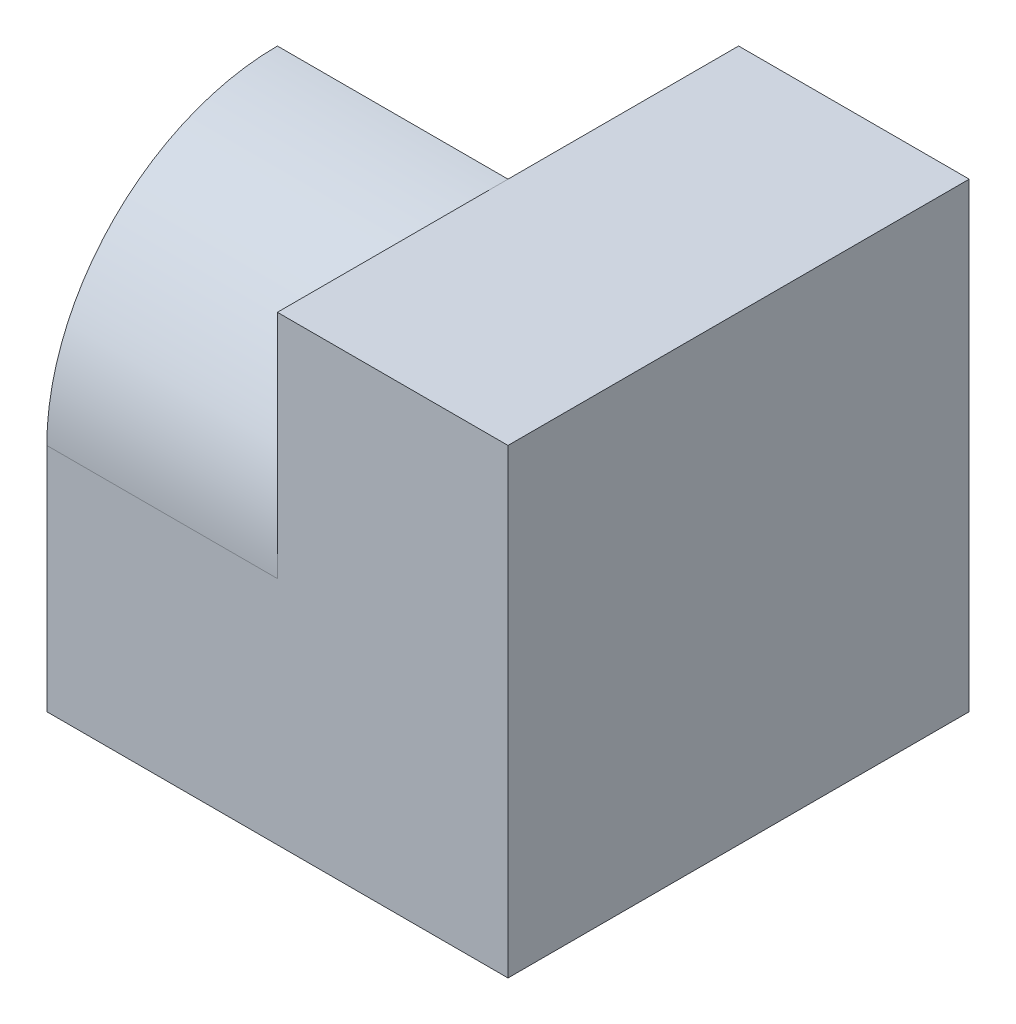
ISO-10303-21;
HEADER;
FILE_DESCRIPTION(('STEP AP214'),'2;1');
FILE_NAME('part.step','',(''),(''),'','','');
FILE_SCHEMA(('AUTOMOTIVE_DESIGN { 1 0 10303 214 1 1 1 1 }'));
ENDSEC;
DATA;
#1=APPLICATION_CONTEXT('core data for automotive mechanical design processes');
#2=APPLICATION_PROTOCOL_DEFINITION('international standard','automotive_design',2000,#1);
#3=PRODUCT_CONTEXT('',#1,'mechanical');
#4=PRODUCT('Part','Part','',(#3));
#5=PRODUCT_RELATED_PRODUCT_CATEGORY('part','',(#4));
#6=PRODUCT_DEFINITION_FORMATION('','',#4);
#7=PRODUCT_DEFINITION_CONTEXT('part definition',#1,'design');
#8=PRODUCT_DEFINITION('design','',#6,#7);
#9=PRODUCT_DEFINITION_SHAPE('','',#8);
#10=(LENGTH_UNIT() NAMED_UNIT(*) SI_UNIT(.MILLI.,.METRE.));
#11=(NAMED_UNIT(*) PLANE_ANGLE_UNIT() SI_UNIT($,.RADIAN.));
#12=(NAMED_UNIT(*) SI_UNIT($,.STERADIAN.) SOLID_ANGLE_UNIT());
#13=UNCERTAINTY_MEASURE_WITH_UNIT(LENGTH_MEASURE(1.E-05),#10,'distance_accuracy_value','');
#14=(GEOMETRIC_REPRESENTATION_CONTEXT(3) GLOBAL_UNCERTAINTY_ASSIGNED_CONTEXT((#13)) GLOBAL_UNIT_ASSIGNED_CONTEXT((#10,
#11,#12)) REPRESENTATION_CONTEXT('',''));
#15=CARTESIAN_POINT('',(0.,0.,0.));
#16=DIRECTION('',(0.,0.,1.));
#17=DIRECTION('',(1.,0.,0.));
#18=AXIS2_PLACEMENT_3D('',#15,#16,#17);
#19=CARTESIAN_POINT('',(-2.,4.,2.));
#20=DIRECTION('',(1.,0.,0.));
#21=DIRECTION('',(0.,0.,-1.));
#22=AXIS2_PLACEMENT_3D('',#19,#20,#21);
#23=PLANE('',#22);
#24=DIRECTION('',(0.,-1.,0.));
#25=VECTOR('',#24,1.);
#26=CARTESIAN_POINT('',(-2.,4.,2.));
#27=LINE('',#26,#25);
#28=CARTESIAN_POINT('',(-2.,1.99999999999999,2.));
#29=VERTEX_POINT('',#28);
#30=CARTESIAN_POINT('',(-2.,0.,2.));
#31=VERTEX_POINT('',#30);
#32=EDGE_CURVE('E81',#29,#31,#27,.T.);
#33=ORIENTED_EDGE('',*,*,#32,.F.);
#34=CARTESIAN_POINT('',(-2.,1.99999999999999,0.));
#35=DIRECTION('',(-1.,0.,0.));
#36=DIRECTION('',(0.,0.,1.));
#37=AXIS2_PLACEMENT_3D('',#34,#35,#36);
#38=CIRCLE('',#37,2.00000000000001);
#39=CARTESIAN_POINT('',(-2.,4.,0.));
#40=VERTEX_POINT('',#39);
#41=EDGE_CURVE('E140',#40,#29,#38,.F.);
#42=ORIENTED_EDGE('',*,*,#41,.F.);
#43=DIRECTION('',(0.,-0.707106781186548,-0.707106781186548));
#44=VECTOR('',#43,1.);
#45=CARTESIAN_POINT('',(-2.,2.,-2.));
#46=LINE('',#45,#44);
#47=CARTESIAN_POINT('',(-2.,2.,-2.));
#48=VERTEX_POINT('',#47);
#49=EDGE_CURVE('E113',#40,#48,#46,.T.);
#50=ORIENTED_EDGE('',*,*,#49,.T.);
#51=DIRECTION('',(0.,-1.,0.));
#52=VECTOR('',#51,1.);
#53=CARTESIAN_POINT('',(-2.,4.,-2.));
#54=LINE('',#53,#52);
#55=CARTESIAN_POINT('',(-2.,0.,-2.));
#56=VERTEX_POINT('',#55);
#57=EDGE_CURVE('E40',#48,#56,#54,.T.);
#58=ORIENTED_EDGE('',*,*,#57,.T.);
#59=DIRECTION('',(0.,0.,1.));
#60=VECTOR('',#59,1.);
#61=CARTESIAN_POINT('',(-2.,0.,2.));
#62=LINE('',#61,#60);
#63=EDGE_CURVE('E87',#56,#31,#62,.T.);
#64=ORIENTED_EDGE('',*,*,#63,.T.);
#65=EDGE_LOOP('',(#33,#42,#50,#58,#64));
#66=FACE_BOUND('',#65,.T.);
#67=ADVANCED_FACE('F32',(#66),#23,.F.);
#68=CARTESIAN_POINT('',(0.,4.,0.));
#69=DIRECTION('',(0.,-1.,0.));
#70=DIRECTION('',(0.,0.,-1.));
#71=AXIS2_PLACEMENT_3D('',#68,#69,#70);
#72=PLANE('',#71);
#73=DIRECTION('',(0.,0.,-1.));
#74=VECTOR('',#73,1.);
#75=CARTESIAN_POINT('',(0.,4.,0.));
#76=LINE('',#75,#74);
#77=CARTESIAN_POINT('',(0.,4.,2.));
#78=VERTEX_POINT('',#77);
#79=CARTESIAN_POINT('',(0.,4.,0.));
#80=VERTEX_POINT('',#79);
#81=EDGE_CURVE('E47',#78,#80,#76,.T.);
#82=ORIENTED_EDGE('',*,*,#81,.F.);
#83=DIRECTION('',(1.,0.,0.));
#84=VECTOR('',#83,1.);
#85=CARTESIAN_POINT('',(-2.,4.,2.));
#86=LINE('',#85,#84);
#87=CARTESIAN_POINT('',(2.,4.,2.));
#88=VERTEX_POINT('',#87);
#89=EDGE_CURVE('E55',#78,#88,#86,.T.);
#90=ORIENTED_EDGE('',*,*,#89,.T.);
#91=DIRECTION('',(0.,0.,-1.));
#92=VECTOR('',#91,1.);
#93=CARTESIAN_POINT('',(2.,4.,2.));
#94=LINE('',#93,#92);
#95=CARTESIAN_POINT('',(2.,4.,-2.));
#96=VERTEX_POINT('',#95);
#97=EDGE_CURVE('E86',#88,#96,#94,.T.);
#98=ORIENTED_EDGE('',*,*,#97,.T.);
#99=DIRECTION('',(-1.,0.,0.));
#100=VECTOR('',#99,1.);
#101=CARTESIAN_POINT('',(-2.,4.,-2.));
#102=LINE('',#101,#100);
#103=CARTESIAN_POINT('',(0.,4.,-2.));
#104=VERTEX_POINT('',#103);
#105=EDGE_CURVE('E119',#96,#104,#102,.T.);
#106=ORIENTED_EDGE('',*,*,#105,.T.);
#107=DIRECTION('',(0.,0.,-1.));
#108=VECTOR('',#107,1.);
#109=CARTESIAN_POINT('',(0.,4.,0.));
#110=LINE('',#109,#108);
#111=EDGE_CURVE('E133',#80,#104,#110,.T.);
#112=ORIENTED_EDGE('',*,*,#111,.F.);
#113=EDGE_LOOP('',(#82,#90,#98,#106,#112));
#114=FACE_BOUND('',#113,.T.);
#115=ADVANCED_FACE('F124',(#114),#72,.F.);
#116=CARTESIAN_POINT('',(-2.,4.,2.));
#117=DIRECTION('',(0.,0.,-1.));
#118=DIRECTION('',(-1.,0.,0.));
#119=AXIS2_PLACEMENT_3D('',#116,#117,#118);
#120=PLANE('',#119);
#121=DIRECTION('',(-1.,0.,0.));
#122=VECTOR('',#121,1.);
#123=CARTESIAN_POINT('',(0.,1.99999999999999,2.));
#124=LINE('',#123,#122);
#125=CARTESIAN_POINT('',(0.,1.99999999999999,2.));
#126=VERTEX_POINT('',#125);
#127=EDGE_CURVE('E131',#126,#29,#124,.T.);
#128=ORIENTED_EDGE('',*,*,#127,.T.);
#129=ORIENTED_EDGE('',*,*,#32,.T.);
#130=DIRECTION('',(1.,0.,0.));
#131=VECTOR('',#130,1.);
#132=CARTESIAN_POINT('',(-2.,0.,2.));
#133=LINE('',#132,#131);
#134=CARTESIAN_POINT('',(2.,0.,2.));
#135=VERTEX_POINT('',#134);
#136=EDGE_CURVE('E74',#31,#135,#133,.T.);
#137=ORIENTED_EDGE('',*,*,#136,.T.);
#138=DIRECTION('',(0.,-1.,0.));
#139=VECTOR('',#138,1.);
#140=CARTESIAN_POINT('',(2.,4.,2.));
#141=LINE('',#140,#139);
#142=EDGE_CURVE('E78',#88,#135,#141,.T.);
#143=ORIENTED_EDGE('',*,*,#142,.F.);
#144=ORIENTED_EDGE('',*,*,#89,.F.);
#145=DIRECTION('',(0.,1.,0.));
#146=VECTOR('',#145,1.);
#147=CARTESIAN_POINT('',(0.,0.,2.));
#148=LINE('',#147,#146);
#149=EDGE_CURVE('E139',#126,#78,#148,.T.);
#150=ORIENTED_EDGE('',*,*,#149,.F.);
#151=EDGE_LOOP('',(#128,#129,#137,#143,#144,#150));
#152=FACE_BOUND('',#151,.T.);
#153=ADVANCED_FACE('F77',(#152),#120,.F.);
#154=CARTESIAN_POINT('',(-2.,4.,-2.));
#155=DIRECTION('',(0.,0.,1.));
#156=DIRECTION('',(1.,0.,0.));
#157=AXIS2_PLACEMENT_3D('',#154,#155,#156);
#158=PLANE('',#157);
#159=DIRECTION('',(-1.,0.,0.));
#160=VECTOR('',#159,1.);
#161=CARTESIAN_POINT('',(0.,2.,-2.));
#162=LINE('',#161,#160);
#163=CARTESIAN_POINT('',(0.,2.,-2.));
#164=VERTEX_POINT('',#163);
#165=EDGE_CURVE('E97',#164,#48,#162,.T.);
#166=ORIENTED_EDGE('',*,*,#165,.F.);
#167=DIRECTION('',(0.,-1.,0.));
#168=VECTOR('',#167,1.);
#169=CARTESIAN_POINT('',(0.,0.,-2.));
#170=LINE('',#169,#168);
#171=EDGE_CURVE('E122',#104,#164,#170,.T.);
#172=ORIENTED_EDGE('',*,*,#171,.F.);
#173=ORIENTED_EDGE('',*,*,#105,.F.);
#174=DIRECTION('',(0.,-1.,0.));
#175=VECTOR('',#174,1.);
#176=CARTESIAN_POINT('',(2.,4.,-2.));
#177=LINE('',#176,#175);
#178=CARTESIAN_POINT('',(2.,0.,-2.));
#179=VERTEX_POINT('',#178);
#180=EDGE_CURVE('E11',#96,#179,#177,.T.);
#181=ORIENTED_EDGE('',*,*,#180,.T.);
#182=DIRECTION('',(-1.,0.,0.));
#183=VECTOR('',#182,1.);
#184=CARTESIAN_POINT('',(-2.,0.,-2.));
#185=LINE('',#184,#183);
#186=EDGE_CURVE('E96',#179,#56,#185,.T.);
#187=ORIENTED_EDGE('',*,*,#186,.T.);
#188=ORIENTED_EDGE('',*,*,#57,.F.);
#189=EDGE_LOOP('',(#166,#172,#173,#181,#187,#188));
#190=FACE_BOUND('',#189,.T.);
#191=ADVANCED_FACE('F116',(#190),#158,.F.);
#192=CARTESIAN_POINT('',(2.,4.,2.));
#193=DIRECTION('',(-1.,0.,0.));
#194=DIRECTION('',(0.,0.,1.));
#195=AXIS2_PLACEMENT_3D('',#192,#193,#194);
#196=PLANE('',#195);
#197=DIRECTION('',(0.,0.,-1.));
#198=VECTOR('',#197,1.);
#199=CARTESIAN_POINT('',(2.,0.,2.));
#200=LINE('',#199,#198);
#201=EDGE_CURVE('E92',#135,#179,#200,.T.);
#202=ORIENTED_EDGE('',*,*,#201,.T.);
#203=ORIENTED_EDGE('',*,*,#180,.F.);
#204=ORIENTED_EDGE('',*,*,#97,.F.);
#205=ORIENTED_EDGE('',*,*,#142,.T.);
#206=EDGE_LOOP('',(#202,#203,#204,#205));
#207=FACE_BOUND('',#206,.T.);
#208=ADVANCED_FACE('F34',(#207),#196,.F.);
#209=CARTESIAN_POINT('',(0.,0.,0.));
#210=DIRECTION('',(0.,-1.,0.));
#211=DIRECTION('',(0.,0.,-1.));
#212=AXIS2_PLACEMENT_3D('',#209,#210,#211);
#213=PLANE('',#212);
#214=ORIENTED_EDGE('',*,*,#201,.F.);
#215=ORIENTED_EDGE('',*,*,#136,.F.);
#216=ORIENTED_EDGE('',*,*,#63,.F.);
#217=ORIENTED_EDGE('',*,*,#186,.F.);
#218=EDGE_LOOP('',(#214,#215,#216,#217));
#219=FACE_BOUND('',#218,.T.);
#220=ADVANCED_FACE('F94',(#219),#213,.T.);
#221=CARTESIAN_POINT('',(0.,2.,-2.));
#222=DIRECTION('',(0.,0.707106781186547,-0.707106781186547));
#223=DIRECTION('',(0.,0.707106781186548,0.707106781186548));
#224=AXIS2_PLACEMENT_3D('',#221,#222,#223);
#225=PLANE('',#224);
#226=ORIENTED_EDGE('',*,*,#49,.F.);
#227=DIRECTION('',(-1.,0.,0.));
#228=VECTOR('',#227,1.);
#229=CARTESIAN_POINT('',(0.,4.,0.));
#230=LINE('',#229,#228);
#231=EDGE_CURVE('E101',#80,#40,#230,.T.);
#232=ORIENTED_EDGE('',*,*,#231,.F.);
#233=DIRECTION('',(0.,-0.707106781186548,-0.707106781186548));
#234=VECTOR('',#233,1.);
#235=CARTESIAN_POINT('',(0.,2.,-2.));
#236=LINE('',#235,#234);
#237=EDGE_CURVE('E130',#80,#164,#236,.T.);
#238=ORIENTED_EDGE('',*,*,#237,.T.);
#239=ORIENTED_EDGE('',*,*,#165,.T.);
#240=EDGE_LOOP('',(#226,#232,#238,#239));
#241=FACE_BOUND('',#240,.T.);
#242=ADVANCED_FACE('F163',(#241),#225,.T.);
#243=CARTESIAN_POINT('',(0.,0.,0.));
#244=DIRECTION('',(-1.,0.,0.));
#245=DIRECTION('',(0.,0.,1.));
#246=AXIS2_PLACEMENT_3D('',#243,#244,#245);
#247=PLANE('',#246);
#248=ORIENTED_EDGE('',*,*,#237,.F.);
#249=ORIENTED_EDGE('',*,*,#111,.T.);
#250=ORIENTED_EDGE('',*,*,#171,.T.);
#251=EDGE_LOOP('',(#248,#249,#250));
#252=FACE_BOUND('',#251,.T.);
#253=ADVANCED_FACE('F165',(#252),#247,.T.);
#254=CARTESIAN_POINT('',(0.,1.99999999999999,0.));
#255=DIRECTION('',(-1.,0.,0.));
#256=DIRECTION('',(0.,0.,1.));
#257=AXIS2_PLACEMENT_3D('',#254,#255,#256);
#258=CYLINDRICAL_SURFACE('',#257,2.00000000000001);
#259=ORIENTED_EDGE('',*,*,#41,.T.);
#260=ORIENTED_EDGE('',*,*,#127,.F.);
#261=CARTESIAN_POINT('',(0.,1.99999999999999,0.));
#262=DIRECTION('',(-1.,0.,0.));
#263=DIRECTION('',(0.,0.,1.));
#264=AXIS2_PLACEMENT_3D('',#261,#262,#263);
#265=CIRCLE('',#264,2.00000000000001);
#266=EDGE_CURVE('E144',#80,#126,#265,.F.);
#267=ORIENTED_EDGE('',*,*,#266,.F.);
#268=ORIENTED_EDGE('',*,*,#231,.T.);
#269=EDGE_LOOP('',(#259,#260,#267,#268));
#270=FACE_BOUND('',#269,.T.);
#271=ADVANCED_FACE('F167',(#270),#258,.T.);
#272=CARTESIAN_POINT('',(0.,0.,0.));
#273=DIRECTION('',(-1.,0.,0.));
#274=DIRECTION('',(0.,0.,1.));
#275=AXIS2_PLACEMENT_3D('',#272,#273,#274);
#276=PLANE('',#275);
#277=ORIENTED_EDGE('',*,*,#81,.T.);
#278=ORIENTED_EDGE('',*,*,#266,.T.);
#279=ORIENTED_EDGE('',*,*,#149,.T.);
#280=EDGE_LOOP('',(#277,#278,#279));
#281=FACE_BOUND('',#280,.T.);
#282=ADVANCED_FACE('F148',(#281),#276,.T.);
#283=CLOSED_SHELL('',(#67,#115,#153,#191,#208,#220,#242,#253,#271,#282));
#284=MANIFOLD_SOLID_BREP('B2',#283);
#285=ADVANCED_BREP_SHAPE_REPRESENTATION('',(#18,#284),#14);
#286=SHAPE_DEFINITION_REPRESENTATION(#9,#285);
ENDSEC;
END-ISO-10303-21;
